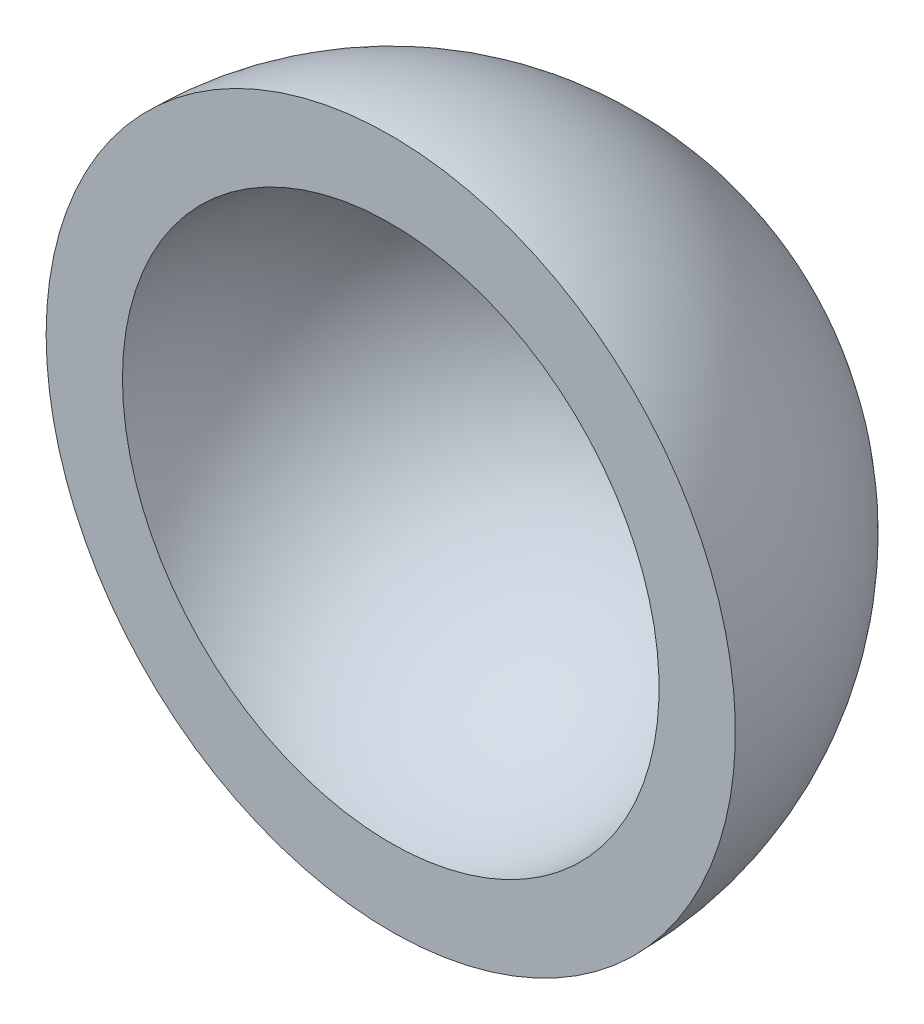
ISO-10303-21;
HEADER;
FILE_DESCRIPTION(('STEP AP214'),'2;1');
FILE_NAME('part.step','',(''),(''),'','','');
FILE_SCHEMA(('AUTOMOTIVE_DESIGN { 1 0 10303 214 1 1 1 1 }'));
ENDSEC;
DATA;
#1=APPLICATION_CONTEXT('core data for automotive mechanical design processes');
#2=APPLICATION_PROTOCOL_DEFINITION('international standard','automotive_design',2000,#1);
#3=PRODUCT_CONTEXT('',#1,'mechanical');
#4=PRODUCT('Part','Part','',(#3));
#5=PRODUCT_RELATED_PRODUCT_CATEGORY('part','',(#4));
#6=PRODUCT_DEFINITION_FORMATION('','',#4);
#7=PRODUCT_DEFINITION_CONTEXT('part definition',#1,'design');
#8=PRODUCT_DEFINITION('design','',#6,#7);
#9=PRODUCT_DEFINITION_SHAPE('','',#8);
#10=(LENGTH_UNIT() NAMED_UNIT(*) SI_UNIT(.MILLI.,.METRE.));
#11=(NAMED_UNIT(*) PLANE_ANGLE_UNIT() SI_UNIT($,.RADIAN.));
#12=(NAMED_UNIT(*) SI_UNIT($,.STERADIAN.) SOLID_ANGLE_UNIT());
#13=UNCERTAINTY_MEASURE_WITH_UNIT(LENGTH_MEASURE(1.E-05),#10,'distance_accuracy_value','');
#14=(GEOMETRIC_REPRESENTATION_CONTEXT(3) GLOBAL_UNCERTAINTY_ASSIGNED_CONTEXT((#13)) GLOBAL_UNIT_ASSIGNED_CONTEXT((#10,
#11,#12)) REPRESENTATION_CONTEXT('',''));
#15=CARTESIAN_POINT('',(0.,0.,0.));
#16=DIRECTION('',(0.,0.,1.));
#17=DIRECTION('',(1.,0.,0.));
#18=AXIS2_PLACEMENT_3D('',#15,#16,#17);
#19=CARTESIAN_POINT('',(0.,0.,0.));
#20=DIRECTION('',(0.,-1.,0.));
#21=DIRECTION('',(1.,0.,0.));
#22=AXIS2_PLACEMENT_3D('',#19,#20,#21);
#23=SPHERICAL_SURFACE('',#22,62.5);
#24=CARTESIAN_POINT('',(0.,0.,0.));
#25=DIRECTION('',(0.,0.,-1.));
#26=DIRECTION('',(-1.,0.,0.));
#27=AXIS2_PLACEMENT_3D('',#24,#25,#26);
#28=SPHERICAL_SURFACE('',#27,62.5);
#29=CARTESIAN_POINT('',(0.,0.,0.));
#30=DIRECTION('',(0.,0.,-1.));
#31=DIRECTION('',(-1.,0.,0.));
#32=AXIS2_PLACEMENT_3D('',#29,#30,#31);
#33=CIRCLE('',#32,62.5);
#34=CARTESIAN_POINT('',(-62.5,0.,4.36435167355392E-13));
#35=VERTEX_POINT('',#34);
#36=EDGE_CURVE('E10',#35,#35,#33,.T.);
#37=ORIENTED_EDGE('',*,*,#36,.T.);
#38=EDGE_LOOP('',(#37));
#39=FACE_BOUND('',#38,.T.);
#40=ADVANCED_FACE('F34',(#39),#28,.T.);
#41=CARTESIAN_POINT('',(0.,0.,0.));
#42=DIRECTION('',(0.,0.,-1.));
#43=DIRECTION('',(-1.,0.,0.));
#44=AXIS2_PLACEMENT_3D('',#41,#42,#43);
#45=PLANE('',#44);
#46=CARTESIAN_POINT('',(0.,0.,0.));
#47=DIRECTION('',(0.,0.,-1.));
#48=DIRECTION('',(-1.,0.,0.));
#49=AXIS2_PLACEMENT_3D('',#46,#47,#48);
#50=CIRCLE('',#49,48.6599999999999);
#51=CARTESIAN_POINT('',(-48.6599999999999,0.,3.39790963896213E-13));
#52=VERTEX_POINT('',#51);
#53=EDGE_CURVE('E40',#52,#52,#50,.T.);
#54=ORIENTED_EDGE('',*,*,#53,.T.);
#55=EDGE_LOOP('',(#54));
#56=FACE_BOUND('',#55,.T.);
#57=ORIENTED_EDGE('',*,*,#36,.F.);
#58=EDGE_LOOP('',(#57));
#59=FACE_BOUND('',#58,.T.);
#60=ADVANCED_FACE('F46',(#56,#59),#45,.F.);
#61=CARTESIAN_POINT('',(0.,0.,0.));
#62=DIRECTION('',(0.,-1.,0.));
#63=DIRECTION('',(1.,0.,0.));
#64=AXIS2_PLACEMENT_3D('',#61,#62,#63);
#65=SPHERICAL_SURFACE('',#64,48.6599999999999);
#66=CARTESIAN_POINT('',(0.,0.,0.));
#67=DIRECTION('',(0.,0.,-1.));
#68=DIRECTION('',(-1.,0.,0.));
#69=AXIS2_PLACEMENT_3D('',#66,#67,#68);
#70=SPHERICAL_SURFACE('',#69,48.6599999999999);
#71=ORIENTED_EDGE('',*,*,#53,.F.);
#72=EDGE_LOOP('',(#71));
#73=FACE_BOUND('',#72,.T.);
#74=ADVANCED_FACE('F49',(#73),#70,.F.);
#75=CLOSED_SHELL('',(#40,#60,#74));
#76=MANIFOLD_SOLID_BREP('B2',#75);
#77=ADVANCED_BREP_SHAPE_REPRESENTATION('',(#18,#76),#14);
#78=SHAPE_DEFINITION_REPRESENTATION(#9,#77);
ENDSEC;
END-ISO-10303-21;
